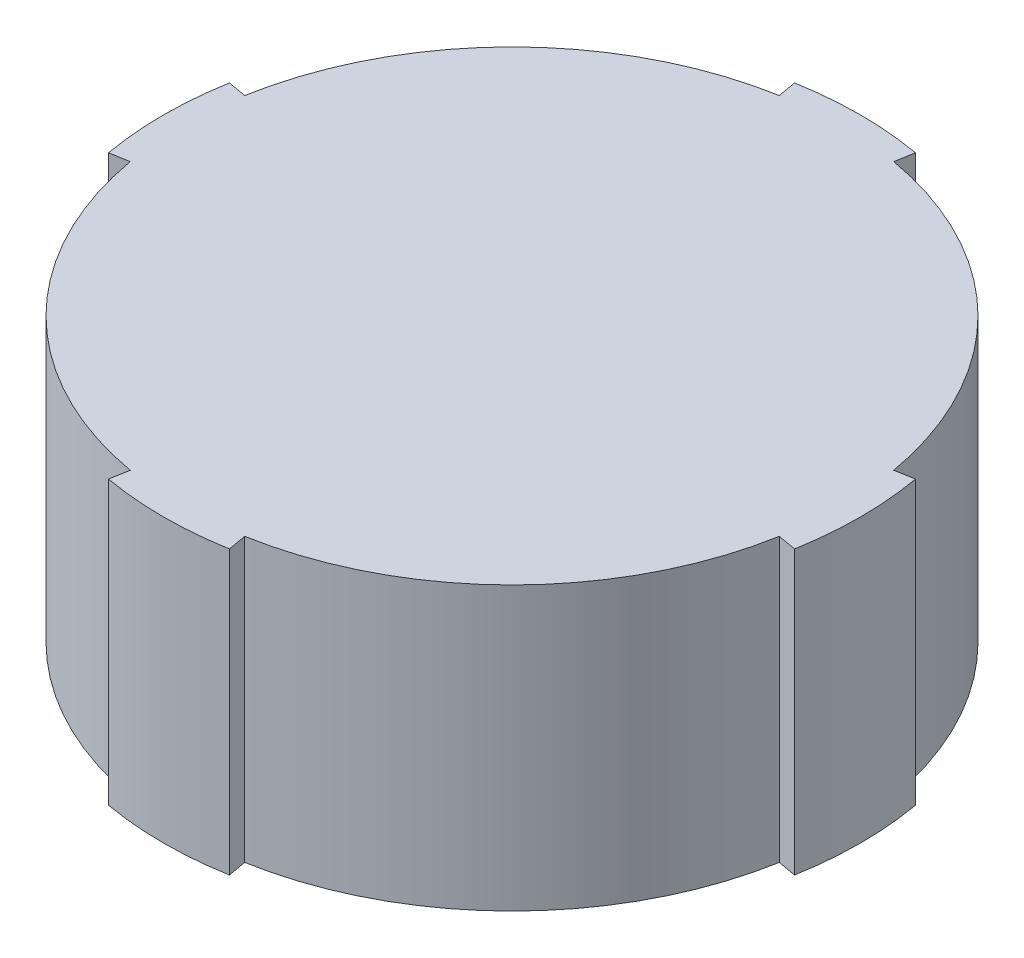
ISO-10303-21;
HEADER;
FILE_DESCRIPTION(('STEP AP214'),'2;1');
FILE_NAME('part.step','',(''),(''),'','','');
FILE_SCHEMA(('AUTOMOTIVE_DESIGN { 1 0 10303 214 1 1 1 1 }'));
ENDSEC;
DATA;
#1=APPLICATION_CONTEXT('core data for automotive mechanical design processes');
#2=APPLICATION_PROTOCOL_DEFINITION('international standard','automotive_design',2000,#1);
#3=PRODUCT_CONTEXT('',#1,'mechanical');
#4=PRODUCT('Part','Part','',(#3));
#5=PRODUCT_RELATED_PRODUCT_CATEGORY('part','',(#4));
#6=PRODUCT_DEFINITION_FORMATION('','',#4);
#7=PRODUCT_DEFINITION_CONTEXT('part definition',#1,'design');
#8=PRODUCT_DEFINITION('design','',#6,#7);
#9=PRODUCT_DEFINITION_SHAPE('','',#8);
#10=(LENGTH_UNIT() NAMED_UNIT(*) SI_UNIT(.MILLI.,.METRE.));
#11=(NAMED_UNIT(*) PLANE_ANGLE_UNIT() SI_UNIT($,.RADIAN.));
#12=(NAMED_UNIT(*) SI_UNIT($,.STERADIAN.) SOLID_ANGLE_UNIT());
#13=UNCERTAINTY_MEASURE_WITH_UNIT(LENGTH_MEASURE(1.E-05),#10,'distance_accuracy_value','');
#14=(GEOMETRIC_REPRESENTATION_CONTEXT(3) GLOBAL_UNCERTAINTY_ASSIGNED_CONTEXT((#13)) GLOBAL_UNIT_ASSIGNED_CONTEXT((#10,
#11,#12)) REPRESENTATION_CONTEXT('',''));
#15=CARTESIAN_POINT('',(0.,0.,0.));
#16=DIRECTION('',(0.,0.,1.));
#17=DIRECTION('',(1.,0.,0.));
#18=AXIS2_PLACEMENT_3D('',#15,#16,#17);
#19=CARTESIAN_POINT('',(0.,30.,0.));
#20=DIRECTION('',(0.,-1.,0.));
#21=DIRECTION('',(0.,0.,-1.));
#22=AXIS2_PLACEMENT_3D('',#19,#20,#21);
#23=CYLINDRICAL_SURFACE('',#22,37.);
#24=DIRECTION('',(0.,1.,0.));
#25=VECTOR('',#24,1.);
#26=CARTESIAN_POINT('',(36.4378868614517,0.,6.42498257367644));
#27=LINE('',#26,#25);
#28=CARTESIAN_POINT('',(36.4378868614517,0.,6.42498257367644));
#29=VERTEX_POINT('',#28);
#30=CARTESIAN_POINT('',(36.4378868614517,30.,6.42498257367644));
#31=VERTEX_POINT('',#30);
#32=EDGE_CURVE('E265',#29,#31,#27,.T.);
#33=ORIENTED_EDGE('',*,*,#32,.F.);
#34=CARTESIAN_POINT('',(0.,0.,0.));
#35=DIRECTION('',(0.,1.,0.));
#36=DIRECTION('',(0.,0.,1.));
#37=AXIS2_PLACEMENT_3D('',#34,#35,#36);
#38=CIRCLE('',#37,37.);
#39=CARTESIAN_POINT('',(36.4378868614517,0.,-6.42498257367646));
#40=VERTEX_POINT('',#39);
#41=EDGE_CURVE('E310',#29,#40,#38,.T.);
#42=ORIENTED_EDGE('',*,*,#41,.T.);
#43=DIRECTION('',(0.,1.,0.));
#44=VECTOR('',#43,1.);
#45=CARTESIAN_POINT('',(36.4378868614517,0.,-6.42498257367646));
#46=LINE('',#45,#44);
#47=CARTESIAN_POINT('',(36.4378868614517,30.,-6.42498257367646));
#48=VERTEX_POINT('',#47);
#49=EDGE_CURVE('E302',#40,#48,#46,.T.);
#50=ORIENTED_EDGE('',*,*,#49,.T.);
#51=CARTESIAN_POINT('',(0.,30.,0.));
#52=DIRECTION('',(0.,1.,0.));
#53=DIRECTION('',(0.,0.,1.));
#54=AXIS2_PLACEMENT_3D('',#51,#52,#53);
#55=CIRCLE('',#54,37.);
#56=EDGE_CURVE('E11',#31,#48,#55,.T.);
#57=ORIENTED_EDGE('',*,*,#56,.F.);
#58=EDGE_LOOP('',(#33,#42,#50,#57));
#59=FACE_BOUND('',#58,.T.);
#60=ADVANCED_FACE('F45',(#59),#23,.T.);
#61=CARTESIAN_POINT('',(-6.42498257367643,0.,36.4378868614517));
#62=VERTEX_POINT('',#61);
#63=CARTESIAN_POINT('',(6.42498257367646,0.,36.4378868614517));
#64=VERTEX_POINT('',#63);
#65=EDGE_CURVE('E48',#62,#64,#38,.T.);
#66=ORIENTED_EDGE('',*,*,#65,.T.);
#67=DIRECTION('',(0.,1.,0.));
#68=VECTOR('',#67,1.);
#69=CARTESIAN_POINT('',(6.42498257367646,0.,36.4378868614517));
#70=LINE('',#69,#68);
#71=CARTESIAN_POINT('',(6.42498257367646,30.,36.4378868614517));
#72=VERTEX_POINT('',#71);
#73=EDGE_CURVE('E268',#64,#72,#70,.T.);
#74=ORIENTED_EDGE('',*,*,#73,.T.);
#75=CARTESIAN_POINT('',(-6.42498257367643,30.,36.4378868614517));
#76=VERTEX_POINT('',#75);
#77=EDGE_CURVE('E55',#76,#72,#55,.T.);
#78=ORIENTED_EDGE('',*,*,#77,.F.);
#79=DIRECTION('',(0.,1.,0.));
#80=VECTOR('',#79,1.);
#81=CARTESIAN_POINT('',(-6.42498257367643,0.,36.4378868614517));
#82=LINE('',#81,#80);
#83=EDGE_CURVE('E233',#62,#76,#82,.T.);
#84=ORIENTED_EDGE('',*,*,#83,.F.);
#85=EDGE_LOOP('',(#66,#74,#78,#84));
#86=FACE_BOUND('',#85,.T.);
#87=ADVANCED_FACE('F356',(#86),#23,.T.);
#88=CARTESIAN_POINT('',(-36.4378868614517,0.,-6.42498257367643));
#89=VERTEX_POINT('',#88);
#90=CARTESIAN_POINT('',(-36.4378868614517,0.,6.42498257367646));
#91=VERTEX_POINT('',#90);
#92=EDGE_CURVE('E323',#89,#91,#38,.T.);
#93=ORIENTED_EDGE('',*,*,#92,.T.);
#94=DIRECTION('',(0.,1.,0.));
#95=VECTOR('',#94,1.);
#96=CARTESIAN_POINT('',(-36.4378868614517,0.,6.42498257367646));
#97=LINE('',#96,#95);
#98=CARTESIAN_POINT('',(-36.4378868614517,30.,6.42498257367646));
#99=VERTEX_POINT('',#98);
#100=EDGE_CURVE('E62',#91,#99,#97,.T.);
#101=ORIENTED_EDGE('',*,*,#100,.T.);
#102=CARTESIAN_POINT('',(-36.4378868614517,30.,-6.42498257367643));
#103=VERTEX_POINT('',#102);
#104=EDGE_CURVE('E309',#103,#99,#55,.T.);
#105=ORIENTED_EDGE('',*,*,#104,.F.);
#106=DIRECTION('',(0.,1.,0.));
#107=VECTOR('',#106,1.);
#108=CARTESIAN_POINT('',(-36.4378868614517,0.,-6.42498257367643));
#109=LINE('',#108,#107);
#110=EDGE_CURVE('E203',#89,#103,#109,.T.);
#111=ORIENTED_EDGE('',*,*,#110,.F.);
#112=EDGE_LOOP('',(#93,#101,#105,#111));
#113=FACE_BOUND('',#112,.T.);
#114=ADVANCED_FACE('F333',(#113),#23,.T.);
#115=CARTESIAN_POINT('',(6.42498257367644,0.,-36.4378868614517));
#116=VERTEX_POINT('',#115);
#117=CARTESIAN_POINT('',(-6.42498257367646,0.,-36.4378868614517));
#118=VERTEX_POINT('',#117);
#119=EDGE_CURVE('E318',#116,#118,#38,.T.);
#120=ORIENTED_EDGE('',*,*,#119,.T.);
#121=DIRECTION('',(0.,1.,0.));
#122=VECTOR('',#121,1.);
#123=CARTESIAN_POINT('',(-6.42498257367646,0.,-36.4378868614517));
#124=LINE('',#123,#122);
#125=CARTESIAN_POINT('',(-6.42498257367646,30.,-36.4378868614517));
#126=VERTEX_POINT('',#125);
#127=EDGE_CURVE('E70',#118,#126,#124,.T.);
#128=ORIENTED_EDGE('',*,*,#127,.T.);
#129=CARTESIAN_POINT('',(6.42498257367644,30.,-36.4378868614517));
#130=VERTEX_POINT('',#129);
#131=EDGE_CURVE('E54',#130,#126,#55,.T.);
#132=ORIENTED_EDGE('',*,*,#131,.F.);
#133=DIRECTION('',(0.,1.,0.));
#134=VECTOR('',#133,1.);
#135=CARTESIAN_POINT('',(6.42498257367644,0.,-36.4378868614517));
#136=LINE('',#135,#134);
#137=EDGE_CURVE('E299',#116,#130,#136,.T.);
#138=ORIENTED_EDGE('',*,*,#137,.F.);
#139=EDGE_LOOP('',(#120,#128,#132,#138));
#140=FACE_BOUND('',#139,.T.);
#141=ADVANCED_FACE('F357',(#140),#23,.T.);
#142=CARTESIAN_POINT('',(0.,30.,0.));
#143=DIRECTION('',(0.,1.,0.));
#144=DIRECTION('',(0.,0.,1.));
#145=AXIS2_PLACEMENT_3D('',#142,#143,#144);
#146=PLANE('',#145);
#147=CARTESIAN_POINT('',(0.,30.,0.));
#148=DIRECTION('',(0.,1.,0.));
#149=DIRECTION('',(0.,0.,1.));
#150=AXIS2_PLACEMENT_3D('',#147,#148,#149);
#151=CIRCLE('',#150,35.);
#152=CARTESIAN_POINT('',(6.0776862183426,30.,34.4682713554273));
#153=VERTEX_POINT('',#152);
#154=CARTESIAN_POINT('',(34.4682713554273,30.,6.07768621834258));
#155=VERTEX_POINT('',#154);
#156=EDGE_CURVE('E252',#153,#155,#151,.T.);
#157=ORIENTED_EDGE('',*,*,#156,.T.);
#158=DIRECTION('',(0.984807753012208,0.,0.173648177666931));
#159=VECTOR('',#158,1.);
#160=CARTESIAN_POINT('',(0.,30.,0.));
#161=LINE('',#160,#159);
#162=EDGE_CURVE('E244',#155,#31,#161,.T.);
#163=ORIENTED_EDGE('',*,*,#162,.T.);
#164=ORIENTED_EDGE('',*,*,#56,.T.);
#165=DIRECTION('',(0.984807753012208,0.,-0.173648177666931));
#166=VECTOR('',#165,1.);
#167=CARTESIAN_POINT('',(0.,30.,0.));
#168=LINE('',#167,#166);
#169=CARTESIAN_POINT('',(34.4682713554273,30.,-6.0776862183426));
#170=VERTEX_POINT('',#169);
#171=EDGE_CURVE('E289',#170,#48,#168,.T.);
#172=ORIENTED_EDGE('',*,*,#171,.F.);
#173=CARTESIAN_POINT('',(0.,30.,0.));
#174=DIRECTION('',(0.,1.,0.));
#175=DIRECTION('',(0.,0.,1.));
#176=AXIS2_PLACEMENT_3D('',#173,#174,#175);
#177=CIRCLE('',#176,35.);
#178=CARTESIAN_POINT('',(6.07768621834258,30.,-34.4682713554273));
#179=VERTEX_POINT('',#178);
#180=EDGE_CURVE('E202',#170,#179,#177,.T.);
#181=ORIENTED_EDGE('',*,*,#180,.T.);
#182=DIRECTION('',(0.173648177666931,0.,-0.984807753012208));
#183=VECTOR('',#182,1.);
#184=CARTESIAN_POINT('',(0.,30.,0.));
#185=LINE('',#184,#183);
#186=EDGE_CURVE('E278',#179,#130,#185,.T.);
#187=ORIENTED_EDGE('',*,*,#186,.T.);
#188=ORIENTED_EDGE('',*,*,#131,.T.);
#189=DIRECTION('',(-0.173648177666931,0.,-0.984807753012208));
#190=VECTOR('',#189,1.);
#191=CARTESIAN_POINT('',(0.,30.,0.));
#192=LINE('',#191,#190);
#193=CARTESIAN_POINT('',(-6.0776862183426,30.,-34.4682713554273));
#194=VERTEX_POINT('',#193);
#195=EDGE_CURVE('E189',#194,#126,#192,.T.);
#196=ORIENTED_EDGE('',*,*,#195,.F.);
#197=CARTESIAN_POINT('',(0.,30.,0.));
#198=DIRECTION('',(0.,1.,0.));
#199=DIRECTION('',(0.,0.,1.));
#200=AXIS2_PLACEMENT_3D('',#197,#198,#199);
#201=CIRCLE('',#200,35.);
#202=CARTESIAN_POINT('',(-34.4682713554273,30.,-6.07768621834257));
#203=VERTEX_POINT('',#202);
#204=EDGE_CURVE('E168',#194,#203,#201,.T.);
#205=ORIENTED_EDGE('',*,*,#204,.T.);
#206=DIRECTION('',(-0.984807753012208,0.,-0.173648177666931));
#207=VECTOR('',#206,1.);
#208=CARTESIAN_POINT('',(0.,30.,0.));
#209=LINE('',#208,#207);
#210=EDGE_CURVE('E185',#203,#103,#209,.T.);
#211=ORIENTED_EDGE('',*,*,#210,.T.);
#212=ORIENTED_EDGE('',*,*,#104,.T.);
#213=DIRECTION('',(-0.984807753012208,0.,0.173648177666931));
#214=VECTOR('',#213,1.);
#215=CARTESIAN_POINT('',(0.,30.,0.));
#216=LINE('',#215,#214);
#217=CARTESIAN_POINT('',(-34.4682713554273,30.,6.0776862183426));
#218=VERTEX_POINT('',#217);
#219=EDGE_CURVE('E223',#218,#99,#216,.T.);
#220=ORIENTED_EDGE('',*,*,#219,.F.);
#221=CARTESIAN_POINT('',(0.,30.,0.));
#222=DIRECTION('',(0.,1.,0.));
#223=DIRECTION('',(0.,0.,1.));
#224=AXIS2_PLACEMENT_3D('',#221,#222,#223);
#225=CIRCLE('',#224,35.);
#226=CARTESIAN_POINT('',(-6.07768621834257,30.,34.4682713554273));
#227=VERTEX_POINT('',#226);
#228=EDGE_CURVE('E219',#218,#227,#225,.T.);
#229=ORIENTED_EDGE('',*,*,#228,.T.);
#230=DIRECTION('',(-0.173648177666931,0.,0.984807753012208));
#231=VECTOR('',#230,1.);
#232=CARTESIAN_POINT('',(0.,30.,0.));
#233=LINE('',#232,#231);
#234=EDGE_CURVE('E212',#227,#76,#233,.T.);
#235=ORIENTED_EDGE('',*,*,#234,.T.);
#236=ORIENTED_EDGE('',*,*,#77,.T.);
#237=DIRECTION('',(0.173648177666931,0.,0.984807753012208));
#238=VECTOR('',#237,1.);
#239=CARTESIAN_POINT('',(0.,30.,0.));
#240=LINE('',#239,#238);
#241=EDGE_CURVE('E256',#153,#72,#240,.T.);
#242=ORIENTED_EDGE('',*,*,#241,.F.);
#243=EDGE_LOOP('',(#157,#163,#164,#172,#181,#187,#188,#196,#205,#211,#212,#220,#229,#235,#236,#242));
#244=FACE_BOUND('',#243,.T.);
#245=ADVANCED_FACE('F343',(#244),#146,.T.);
#246=CARTESIAN_POINT('',(0.,0.,0.));
#247=DIRECTION('',(0.,1.,0.));
#248=DIRECTION('',(0.,0.,1.));
#249=AXIS2_PLACEMENT_3D('',#246,#247,#248);
#250=PLANE('',#249);
#251=DIRECTION('',(0.984807753012208,0.,0.173648177666931));
#252=VECTOR('',#251,1.);
#253=CARTESIAN_POINT('',(0.,0.,0.));
#254=LINE('',#253,#252);
#255=CARTESIAN_POINT('',(34.4682713554273,0.,6.07768621834258));
#256=VERTEX_POINT('',#255);
#257=EDGE_CURVE('E248',#256,#29,#254,.T.);
#258=ORIENTED_EDGE('',*,*,#257,.F.);
#259=CARTESIAN_POINT('',(0.,0.,0.));
#260=DIRECTION('',(0.,1.,0.));
#261=DIRECTION('',(0.,0.,1.));
#262=AXIS2_PLACEMENT_3D('',#259,#260,#261);
#263=CIRCLE('',#262,35.);
#264=CARTESIAN_POINT('',(6.0776862183426,0.,34.4682713554273));
#265=VERTEX_POINT('',#264);
#266=EDGE_CURVE('E240',#265,#256,#263,.T.);
#267=ORIENTED_EDGE('',*,*,#266,.F.);
#268=DIRECTION('',(0.173648177666931,0.,0.984807753012208));
#269=VECTOR('',#268,1.);
#270=CARTESIAN_POINT('',(0.,0.,0.));
#271=LINE('',#270,#269);
#272=EDGE_CURVE('E243',#265,#64,#271,.T.);
#273=ORIENTED_EDGE('',*,*,#272,.T.);
#274=ORIENTED_EDGE('',*,*,#65,.F.);
#275=DIRECTION('',(-0.173648177666931,0.,0.984807753012208));
#276=VECTOR('',#275,1.);
#277=CARTESIAN_POINT('',(0.,0.,0.));
#278=LINE('',#277,#276);
#279=CARTESIAN_POINT('',(-6.07768621834257,0.,34.4682713554273));
#280=VERTEX_POINT('',#279);
#281=EDGE_CURVE('E215',#280,#62,#278,.T.);
#282=ORIENTED_EDGE('',*,*,#281,.F.);
#283=CARTESIAN_POINT('',(0.,0.,0.));
#284=DIRECTION('',(0.,1.,0.));
#285=DIRECTION('',(0.,0.,1.));
#286=AXIS2_PLACEMENT_3D('',#283,#284,#285);
#287=CIRCLE('',#286,35.);
#288=CARTESIAN_POINT('',(-34.4682713554273,0.,6.0776862183426));
#289=VERTEX_POINT('',#288);
#290=EDGE_CURVE('E208',#289,#280,#287,.T.);
#291=ORIENTED_EDGE('',*,*,#290,.F.);
#292=DIRECTION('',(-0.984807753012208,0.,0.173648177666931));
#293=VECTOR('',#292,1.);
#294=CARTESIAN_POINT('',(0.,0.,0.));
#295=LINE('',#294,#293);
#296=EDGE_CURVE('E211',#289,#91,#295,.T.);
#297=ORIENTED_EDGE('',*,*,#296,.T.);
#298=ORIENTED_EDGE('',*,*,#92,.F.);
#299=DIRECTION('',(-0.984807753012208,0.,-0.173648177666931));
#300=VECTOR('',#299,1.);
#301=CARTESIAN_POINT('',(0.,0.,0.));
#302=LINE('',#301,#300);
#303=CARTESIAN_POINT('',(-34.4682713554273,0.,-6.07768621834257));
#304=VERTEX_POINT('',#303);
#305=EDGE_CURVE('E171',#304,#89,#302,.T.);
#306=ORIENTED_EDGE('',*,*,#305,.F.);
#307=CARTESIAN_POINT('',(0.,0.,0.));
#308=DIRECTION('',(0.,1.,0.));
#309=DIRECTION('',(0.,0.,1.));
#310=AXIS2_PLACEMENT_3D('',#307,#308,#309);
#311=CIRCLE('',#310,35.);
#312=CARTESIAN_POINT('',(-6.0776862183426,0.,-34.4682713554273));
#313=VERTEX_POINT('',#312);
#314=EDGE_CURVE('E165',#313,#304,#311,.T.);
#315=ORIENTED_EDGE('',*,*,#314,.F.);
#316=DIRECTION('',(-0.173648177666931,0.,-0.984807753012208));
#317=VECTOR('',#316,1.);
#318=CARTESIAN_POINT('',(0.,0.,0.));
#319=LINE('',#318,#317);
#320=EDGE_CURVE('E173',#313,#118,#319,.T.);
#321=ORIENTED_EDGE('',*,*,#320,.T.);
#322=ORIENTED_EDGE('',*,*,#119,.F.);
#323=DIRECTION('',(0.173648177666931,0.,-0.984807753012208));
#324=VECTOR('',#323,1.);
#325=CARTESIAN_POINT('',(0.,0.,0.));
#326=LINE('',#325,#324);
#327=CARTESIAN_POINT('',(6.07768621834258,0.,-34.4682713554273));
#328=VERTEX_POINT('',#327);
#329=EDGE_CURVE('E282',#328,#116,#326,.T.);
#330=ORIENTED_EDGE('',*,*,#329,.F.);
#331=CARTESIAN_POINT('',(0.,0.,0.));
#332=DIRECTION('',(0.,1.,0.));
#333=DIRECTION('',(0.,0.,1.));
#334=AXIS2_PLACEMENT_3D('',#331,#332,#333);
#335=CIRCLE('',#334,35.);
#336=CARTESIAN_POINT('',(34.4682713554273,0.,-6.0776862183426));
#337=VERTEX_POINT('',#336);
#338=EDGE_CURVE('E274',#337,#328,#335,.T.);
#339=ORIENTED_EDGE('',*,*,#338,.F.);
#340=DIRECTION('',(0.984807753012208,0.,-0.173648177666931));
#341=VECTOR('',#340,1.);
#342=CARTESIAN_POINT('',(0.,0.,0.));
#343=LINE('',#342,#341);
#344=EDGE_CURVE('E277',#337,#40,#343,.T.);
#345=ORIENTED_EDGE('',*,*,#344,.T.);
#346=ORIENTED_EDGE('',*,*,#41,.F.);
#347=EDGE_LOOP('',(#258,#267,#273,#274,#282,#291,#297,#298,#306,#315,#321,#322,#330,#339,#345,#346));
#348=FACE_BOUND('',#347,.T.);
#349=ADVANCED_FACE('F182',(#348),#250,.F.);
#350=CARTESIAN_POINT('',(0.,0.,0.));
#351=DIRECTION('',(0.,1.,0.));
#352=DIRECTION('',(0.,0.,1.));
#353=AXIS2_PLACEMENT_3D('',#350,#351,#352);
#354=CYLINDRICAL_SURFACE('',#353,35.);
#355=ORIENTED_EDGE('',*,*,#180,.F.);
#356=DIRECTION('',(0.,1.,0.));
#357=VECTOR('',#356,1.);
#358=CARTESIAN_POINT('',(34.4682713554273,0.,-6.0776862183426));
#359=LINE('',#358,#357);
#360=EDGE_CURVE('E285',#337,#170,#359,.T.);
#361=ORIENTED_EDGE('',*,*,#360,.F.);
#362=ORIENTED_EDGE('',*,*,#338,.T.);
#363=DIRECTION('',(0.,1.,0.));
#364=VECTOR('',#363,1.);
#365=CARTESIAN_POINT('',(6.07768621834258,0.,-34.4682713554273));
#366=LINE('',#365,#364);
#367=EDGE_CURVE('E295',#328,#179,#366,.T.);
#368=ORIENTED_EDGE('',*,*,#367,.T.);
#369=EDGE_LOOP('',(#355,#361,#362,#368));
#370=FACE_BOUND('',#369,.T.);
#371=ADVANCED_FACE('F378',(#370),#354,.T.);
#372=CARTESIAN_POINT('',(0.,0.,0.));
#373=DIRECTION('',(0.984807753012208,0.,0.173648177666931));
#374=DIRECTION('',(0.173648177666931,0.,-0.984807753012208));
#375=AXIS2_PLACEMENT_3D('',#372,#373,#374);
#376=PLANE('',#375);
#377=ORIENTED_EDGE('',*,*,#186,.F.);
#378=ORIENTED_EDGE('',*,*,#367,.F.);
#379=ORIENTED_EDGE('',*,*,#329,.T.);
#380=ORIENTED_EDGE('',*,*,#137,.T.);
#381=EDGE_LOOP('',(#377,#378,#379,#380));
#382=FACE_BOUND('',#381,.T.);
#383=ADVANCED_FACE('F375',(#382),#376,.T.);
#384=CARTESIAN_POINT('',(0.,0.,0.));
#385=DIRECTION('',(0.173648177666931,0.,0.984807753012208));
#386=DIRECTION('',(0.984807753012208,0.,-0.173648177666931));
#387=AXIS2_PLACEMENT_3D('',#384,#385,#386);
#388=PLANE('',#387);
#389=ORIENTED_EDGE('',*,*,#171,.T.);
#390=ORIENTED_EDGE('',*,*,#49,.F.);
#391=ORIENTED_EDGE('',*,*,#344,.F.);
#392=ORIENTED_EDGE('',*,*,#360,.T.);
#393=EDGE_LOOP('',(#389,#390,#391,#392));
#394=FACE_BOUND('',#393,.T.);
#395=ADVANCED_FACE('F353',(#394),#388,.F.);
#396=CARTESIAN_POINT('',(0.,0.,0.));
#397=DIRECTION('',(0.,1.,0.));
#398=DIRECTION('',(0.,0.,1.));
#399=AXIS2_PLACEMENT_3D('',#396,#397,#398);
#400=CYLINDRICAL_SURFACE('',#399,35.);
#401=ORIENTED_EDGE('',*,*,#204,.F.);
#402=DIRECTION('',(0.,1.,0.));
#403=VECTOR('',#402,1.);
#404=CARTESIAN_POINT('',(-6.0776862183426,0.,-34.4682713554273));
#405=LINE('',#404,#403);
#406=EDGE_CURVE('E161',#313,#194,#405,.T.);
#407=ORIENTED_EDGE('',*,*,#406,.F.);
#408=ORIENTED_EDGE('',*,*,#314,.T.);
#409=DIRECTION('',(0.,1.,0.));
#410=VECTOR('',#409,1.);
#411=CARTESIAN_POINT('',(-34.4682713554273,0.,-6.07768621834257));
#412=LINE('',#411,#410);
#413=EDGE_CURVE('E199',#304,#203,#412,.T.);
#414=ORIENTED_EDGE('',*,*,#413,.T.);
#415=EDGE_LOOP('',(#401,#407,#408,#414));
#416=FACE_BOUND('',#415,.T.);
#417=ADVANCED_FACE('F162',(#416),#400,.T.);
#418=CARTESIAN_POINT('',(0.,0.,0.));
#419=DIRECTION('',(0.173648177666931,0.,-0.984807753012208));
#420=DIRECTION('',(-0.984807753012208,0.,-0.173648177666931));
#421=AXIS2_PLACEMENT_3D('',#418,#419,#420);
#422=PLANE('',#421);
#423=ORIENTED_EDGE('',*,*,#210,.F.);
#424=ORIENTED_EDGE('',*,*,#413,.F.);
#425=ORIENTED_EDGE('',*,*,#305,.T.);
#426=ORIENTED_EDGE('',*,*,#110,.T.);
#427=EDGE_LOOP('',(#423,#424,#425,#426));
#428=FACE_BOUND('',#427,.T.);
#429=ADVANCED_FACE('F345',(#428),#422,.T.);
#430=CARTESIAN_POINT('',(0.,0.,0.));
#431=DIRECTION('',(0.984807753012208,0.,-0.173648177666931));
#432=DIRECTION('',(-0.173648177666931,0.,-0.984807753012208));
#433=AXIS2_PLACEMENT_3D('',#430,#431,#432);
#434=PLANE('',#433);
#435=ORIENTED_EDGE('',*,*,#195,.T.);
#436=ORIENTED_EDGE('',*,*,#127,.F.);
#437=ORIENTED_EDGE('',*,*,#320,.F.);
#438=ORIENTED_EDGE('',*,*,#406,.T.);
#439=EDGE_LOOP('',(#435,#436,#437,#438));
#440=FACE_BOUND('',#439,.T.);
#441=ADVANCED_FACE('F174',(#440),#434,.F.);
#442=CARTESIAN_POINT('',(0.,0.,0.));
#443=DIRECTION('',(0.,1.,0.));
#444=DIRECTION('',(0.,0.,1.));
#445=AXIS2_PLACEMENT_3D('',#442,#443,#444);
#446=CYLINDRICAL_SURFACE('',#445,35.);
#447=ORIENTED_EDGE('',*,*,#228,.F.);
#448=DIRECTION('',(0.,1.,0.));
#449=VECTOR('',#448,1.);
#450=CARTESIAN_POINT('',(-34.4682713554273,0.,6.0776862183426));
#451=LINE('',#450,#449);
#452=EDGE_CURVE('E218',#289,#218,#451,.T.);
#453=ORIENTED_EDGE('',*,*,#452,.F.);
#454=ORIENTED_EDGE('',*,*,#290,.T.);
#455=DIRECTION('',(0.,1.,0.));
#456=VECTOR('',#455,1.);
#457=CARTESIAN_POINT('',(-6.07768621834257,0.,34.4682713554273));
#458=LINE('',#457,#456);
#459=EDGE_CURVE('E196',#280,#227,#458,.T.);
#460=ORIENTED_EDGE('',*,*,#459,.T.);
#461=EDGE_LOOP('',(#447,#453,#454,#460));
#462=FACE_BOUND('',#461,.T.);
#463=ADVANCED_FACE('F341',(#462),#446,.T.);
#464=CARTESIAN_POINT('',(0.,0.,0.));
#465=DIRECTION('',(-0.984807753012208,0.,-0.173648177666931));
#466=DIRECTION('',(-0.173648177666931,0.,0.984807753012208));
#467=AXIS2_PLACEMENT_3D('',#464,#465,#466);
#468=PLANE('',#467);
#469=ORIENTED_EDGE('',*,*,#234,.F.);
#470=ORIENTED_EDGE('',*,*,#459,.F.);
#471=ORIENTED_EDGE('',*,*,#281,.T.);
#472=ORIENTED_EDGE('',*,*,#83,.T.);
#473=EDGE_LOOP('',(#469,#470,#471,#472));
#474=FACE_BOUND('',#473,.T.);
#475=ADVANCED_FACE('F394',(#474),#468,.T.);
#476=CARTESIAN_POINT('',(0.,0.,0.));
#477=DIRECTION('',(-0.173648177666931,0.,-0.984807753012208));
#478=DIRECTION('',(-0.984807753012208,0.,0.173648177666931));
#479=AXIS2_PLACEMENT_3D('',#476,#477,#478);
#480=PLANE('',#479);
#481=ORIENTED_EDGE('',*,*,#219,.T.);
#482=ORIENTED_EDGE('',*,*,#100,.F.);
#483=ORIENTED_EDGE('',*,*,#296,.F.);
#484=ORIENTED_EDGE('',*,*,#452,.T.);
#485=EDGE_LOOP('',(#481,#482,#483,#484));
#486=FACE_BOUND('',#485,.T.);
#487=ADVANCED_FACE('F337',(#486),#480,.F.);
#488=CARTESIAN_POINT('',(0.,0.,0.));
#489=DIRECTION('',(0.,1.,0.));
#490=DIRECTION('',(0.,0.,1.));
#491=AXIS2_PLACEMENT_3D('',#488,#489,#490);
#492=CYLINDRICAL_SURFACE('',#491,35.);
#493=ORIENTED_EDGE('',*,*,#156,.F.);
#494=DIRECTION('',(0.,1.,0.));
#495=VECTOR('',#494,1.);
#496=CARTESIAN_POINT('',(6.0776862183426,0.,34.4682713554273));
#497=LINE('',#496,#495);
#498=EDGE_CURVE('E251',#265,#153,#497,.T.);
#499=ORIENTED_EDGE('',*,*,#498,.F.);
#500=ORIENTED_EDGE('',*,*,#266,.T.);
#501=DIRECTION('',(0.,1.,0.));
#502=VECTOR('',#501,1.);
#503=CARTESIAN_POINT('',(34.4682713554273,0.,6.07768621834258));
#504=LINE('',#503,#502);
#505=EDGE_CURVE('E224',#256,#155,#504,.T.);
#506=ORIENTED_EDGE('',*,*,#505,.T.);
#507=EDGE_LOOP('',(#493,#499,#500,#506));
#508=FACE_BOUND('',#507,.T.);
#509=ADVANCED_FACE('F389',(#508),#492,.T.);
#510=CARTESIAN_POINT('',(0.,0.,0.));
#511=DIRECTION('',(-0.173648177666931,0.,0.984807753012208));
#512=DIRECTION('',(0.984807753012208,0.,0.173648177666931));
#513=AXIS2_PLACEMENT_3D('',#510,#511,#512);
#514=PLANE('',#513);
#515=ORIENTED_EDGE('',*,*,#162,.F.);
#516=ORIENTED_EDGE('',*,*,#505,.F.);
#517=ORIENTED_EDGE('',*,*,#257,.T.);
#518=ORIENTED_EDGE('',*,*,#32,.T.);
#519=EDGE_LOOP('',(#515,#516,#517,#518));
#520=FACE_BOUND('',#519,.T.);
#521=ADVANCED_FACE('F386',(#520),#514,.T.);
#522=CARTESIAN_POINT('',(0.,0.,0.));
#523=DIRECTION('',(-0.984807753012208,0.,0.173648177666931));
#524=DIRECTION('',(0.173648177666931,0.,0.984807753012208));
#525=AXIS2_PLACEMENT_3D('',#522,#523,#524);
#526=PLANE('',#525);
#527=ORIENTED_EDGE('',*,*,#241,.T.);
#528=ORIENTED_EDGE('',*,*,#73,.F.);
#529=ORIENTED_EDGE('',*,*,#272,.F.);
#530=ORIENTED_EDGE('',*,*,#498,.T.);
#531=EDGE_LOOP('',(#527,#528,#529,#530));
#532=FACE_BOUND('',#531,.T.);
#533=ADVANCED_FACE('F391',(#532),#526,.F.);
#534=CLOSED_SHELL('',(#60,#87,#114,#141,#245,#349,#371,#383,#395,#417,#429,#441,#463,#475,#487,
#509,#521,#533));
#535=MANIFOLD_SOLID_BREP('B2',#534);
#536=ADVANCED_BREP_SHAPE_REPRESENTATION('',(#18,#535),#14);
#537=SHAPE_DEFINITION_REPRESENTATION(#9,#536);
ENDSEC;
END-ISO-10303-21;
